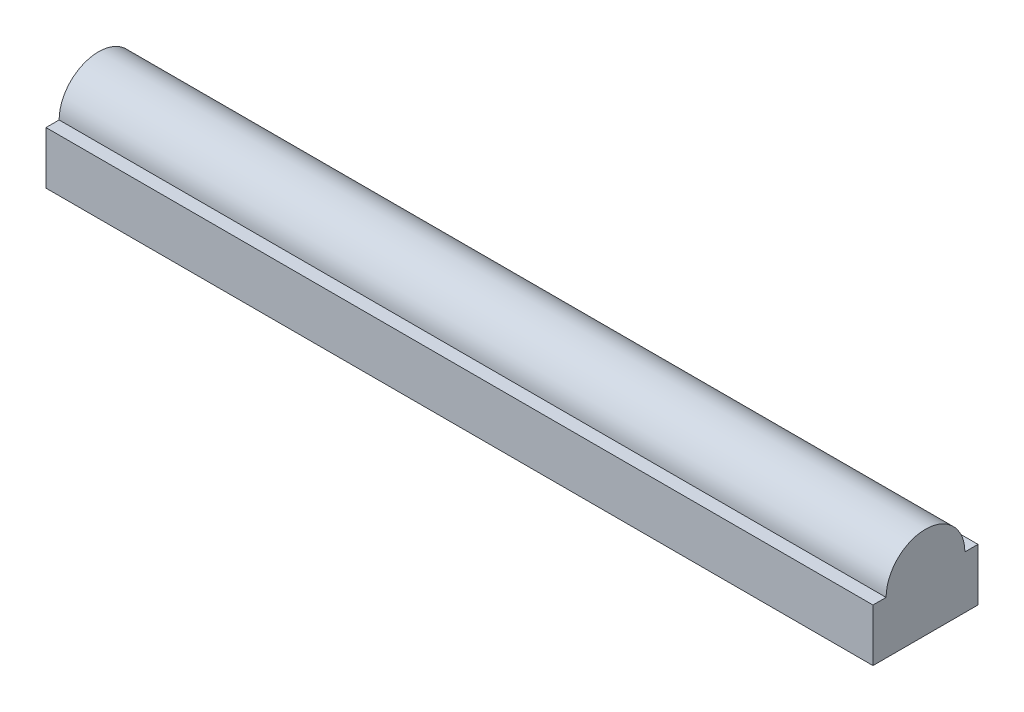
ISO-10303-21;
HEADER;
FILE_DESCRIPTION(('STEP AP214'),'2;1');
FILE_NAME('part.step','',(''),(''),'','','');
FILE_SCHEMA(('AUTOMOTIVE_DESIGN { 1 0 10303 214 1 1 1 1 }'));
ENDSEC;
DATA;
#1=APPLICATION_CONTEXT('core data for automotive mechanical design processes');
#2=APPLICATION_PROTOCOL_DEFINITION('international standard','automotive_design',2000,#1);
#3=PRODUCT_CONTEXT('',#1,'mechanical');
#4=PRODUCT('Part','Part','',(#3));
#5=PRODUCT_RELATED_PRODUCT_CATEGORY('part','',(#4));
#6=PRODUCT_DEFINITION_FORMATION('','',#4);
#7=PRODUCT_DEFINITION_CONTEXT('part definition',#1,'design');
#8=PRODUCT_DEFINITION('design','',#6,#7);
#9=PRODUCT_DEFINITION_SHAPE('','',#8);
#10=(LENGTH_UNIT() NAMED_UNIT(*) SI_UNIT(.MILLI.,.METRE.));
#11=(NAMED_UNIT(*) PLANE_ANGLE_UNIT() SI_UNIT($,.RADIAN.));
#12=(NAMED_UNIT(*) SI_UNIT($,.STERADIAN.) SOLID_ANGLE_UNIT());
#13=UNCERTAINTY_MEASURE_WITH_UNIT(LENGTH_MEASURE(1.E-05),#10,'distance_accuracy_value','');
#14=(GEOMETRIC_REPRESENTATION_CONTEXT(3) GLOBAL_UNCERTAINTY_ASSIGNED_CONTEXT((#13)) GLOBAL_UNIT_ASSIGNED_CONTEXT((#10,
#11,#12)) REPRESENTATION_CONTEXT('',''));
#15=CARTESIAN_POINT('',(0.,0.,0.));
#16=DIRECTION('',(0.,0.,1.));
#17=DIRECTION('',(1.,0.,0.));
#18=AXIS2_PLACEMENT_3D('',#15,#16,#17);
#19=CARTESIAN_POINT('',(400.,25.4,0.));
#20=DIRECTION('',(0.,0.,-1.));
#21=DIRECTION('',(-1.,0.,0.));
#22=AXIS2_PLACEMENT_3D('',#19,#20,#21);
#23=PLANE('',#22);
#24=DIRECTION('',(0.,-1.,0.));
#25=VECTOR('',#24,1.);
#26=CARTESIAN_POINT('',(0.,25.4,0.));
#27=LINE('',#26,#25);
#28=CARTESIAN_POINT('',(0.,25.4,0.));
#29=VERTEX_POINT('',#28);
#30=CARTESIAN_POINT('',(0.,0.,0.));
#31=VERTEX_POINT('',#30);
#32=EDGE_CURVE('E117',#29,#31,#27,.T.);
#33=ORIENTED_EDGE('',*,*,#32,.T.);
#34=DIRECTION('',(-1.,0.,0.));
#35=VECTOR('',#34,1.);
#36=CARTESIAN_POINT('',(400.,0.,0.));
#37=LINE('',#36,#35);
#38=CARTESIAN_POINT('',(400.,0.,0.));
#39=VERTEX_POINT('',#38);
#40=EDGE_CURVE('E11',#39,#31,#37,.T.);
#41=ORIENTED_EDGE('',*,*,#40,.F.);
#42=DIRECTION('',(0.,-1.,0.));
#43=VECTOR('',#42,1.);
#44=CARTESIAN_POINT('',(400.,25.4,0.));
#45=LINE('',#44,#43);
#46=CARTESIAN_POINT('',(400.,25.4,0.));
#47=VERTEX_POINT('',#46);
#48=EDGE_CURVE('E127',#47,#39,#45,.T.);
#49=ORIENTED_EDGE('',*,*,#48,.F.);
#50=DIRECTION('',(-1.,0.,0.));
#51=VECTOR('',#50,1.);
#52=CARTESIAN_POINT('',(400.,25.4,0.));
#53=LINE('',#52,#51);
#54=EDGE_CURVE('E113',#47,#29,#53,.T.);
#55=ORIENTED_EDGE('',*,*,#54,.T.);
#56=EDGE_LOOP('',(#33,#41,#49,#55));
#57=FACE_BOUND('',#56,.T.);
#58=ADVANCED_FACE('F33',(#57),#23,.F.);
#59=CARTESIAN_POINT('',(400.,0.,0.));
#60=DIRECTION('',(0.,1.,0.));
#61=DIRECTION('',(0.,0.,1.));
#62=AXIS2_PLACEMENT_3D('',#59,#60,#61);
#63=PLANE('',#62);
#64=DIRECTION('',(0.,0.,-1.));
#65=VECTOR('',#64,1.);
#66=CARTESIAN_POINT('',(0.,0.,0.));
#67=LINE('',#66,#65);
#68=CARTESIAN_POINT('',(0.,0.,-50.8));
#69=VERTEX_POINT('',#68);
#70=EDGE_CURVE('E120',#31,#69,#67,.T.);
#71=ORIENTED_EDGE('',*,*,#70,.T.);
#72=DIRECTION('',(-1.,0.,0.));
#73=VECTOR('',#72,1.);
#74=CARTESIAN_POINT('',(400.,0.,-50.8));
#75=LINE('',#74,#73);
#76=CARTESIAN_POINT('',(400.,0.,-50.8));
#77=VERTEX_POINT('',#76);
#78=EDGE_CURVE('E41',#77,#69,#75,.T.);
#79=ORIENTED_EDGE('',*,*,#78,.F.);
#80=DIRECTION('',(0.,0.,-1.));
#81=VECTOR('',#80,1.);
#82=CARTESIAN_POINT('',(400.,0.,0.));
#83=LINE('',#82,#81);
#84=EDGE_CURVE('E86',#39,#77,#83,.T.);
#85=ORIENTED_EDGE('',*,*,#84,.F.);
#86=ORIENTED_EDGE('',*,*,#40,.T.);
#87=EDGE_LOOP('',(#71,#79,#85,#86));
#88=FACE_BOUND('',#87,.T.);
#89=ADVANCED_FACE('F151',(#88),#63,.F.);
#90=CARTESIAN_POINT('',(400.,0.,-50.8));
#91=DIRECTION('',(0.,0.,1.));
#92=DIRECTION('',(1.,0.,0.));
#93=AXIS2_PLACEMENT_3D('',#90,#91,#92);
#94=PLANE('',#93);
#95=DIRECTION('',(0.,1.,0.));
#96=VECTOR('',#95,1.);
#97=CARTESIAN_POINT('',(0.,0.,-50.8));
#98=LINE('',#97,#96);
#99=CARTESIAN_POINT('',(0.,25.4,-50.8));
#100=VERTEX_POINT('',#99);
#101=EDGE_CURVE('E122',#69,#100,#98,.T.);
#102=ORIENTED_EDGE('',*,*,#101,.T.);
#103=DIRECTION('',(-1.,0.,0.));
#104=VECTOR('',#103,1.);
#105=CARTESIAN_POINT('',(400.,25.4,-50.8));
#106=LINE('',#105,#104);
#107=CARTESIAN_POINT('',(400.,25.4,-50.8));
#108=VERTEX_POINT('',#107);
#109=EDGE_CURVE('E108',#108,#100,#106,.T.);
#110=ORIENTED_EDGE('',*,*,#109,.F.);
#111=DIRECTION('',(0.,1.,0.));
#112=VECTOR('',#111,1.);
#113=CARTESIAN_POINT('',(400.,0.,-50.8));
#114=LINE('',#113,#112);
#115=EDGE_CURVE('E99',#77,#108,#114,.T.);
#116=ORIENTED_EDGE('',*,*,#115,.F.);
#117=ORIENTED_EDGE('',*,*,#78,.T.);
#118=EDGE_LOOP('',(#102,#110,#116,#117));
#119=FACE_BOUND('',#118,.T.);
#120=ADVANCED_FACE('F133',(#119),#94,.F.);
#121=CARTESIAN_POINT('',(400.,25.4,-50.8));
#122=DIRECTION('',(0.,-1.,0.));
#123=DIRECTION('',(0.,0.,-1.));
#124=AXIS2_PLACEMENT_3D('',#121,#122,#123);
#125=PLANE('',#124);
#126=DIRECTION('',(0.,0.,1.));
#127=VECTOR('',#126,1.);
#128=CARTESIAN_POINT('',(0.,25.4,-50.8));
#129=LINE('',#128,#127);
#130=CARTESIAN_POINT('',(0.,25.4,-44.45));
#131=VERTEX_POINT('',#130);
#132=EDGE_CURVE('E107',#100,#131,#129,.T.);
#133=ORIENTED_EDGE('',*,*,#132,.T.);
#134=DIRECTION('',(-1.,0.,0.));
#135=VECTOR('',#134,1.);
#136=CARTESIAN_POINT('',(400.,25.4,-44.45));
#137=LINE('',#136,#135);
#138=CARTESIAN_POINT('',(400.,25.4,-44.45));
#139=VERTEX_POINT('',#138);
#140=EDGE_CURVE('E104',#139,#131,#137,.T.);
#141=ORIENTED_EDGE('',*,*,#140,.F.);
#142=DIRECTION('',(0.,0.,1.));
#143=VECTOR('',#142,1.);
#144=CARTESIAN_POINT('',(400.,25.4,-50.8));
#145=LINE('',#144,#143);
#146=EDGE_CURVE('E93',#108,#139,#145,.T.);
#147=ORIENTED_EDGE('',*,*,#146,.F.);
#148=ORIENTED_EDGE('',*,*,#109,.T.);
#149=EDGE_LOOP('',(#133,#141,#147,#148));
#150=FACE_BOUND('',#149,.T.);
#151=ADVANCED_FACE('F105',(#150),#125,.F.);
#152=CARTESIAN_POINT('',(400.,25.4,-25.4));
#153=DIRECTION('',(-1.,0.,0.));
#154=DIRECTION('',(0.,0.,1.));
#155=AXIS2_PLACEMENT_3D('',#152,#153,#154);
#156=CYLINDRICAL_SURFACE('',#155,19.05);
#157=CARTESIAN_POINT('',(0.,25.4,-25.4));
#158=DIRECTION('',(1.,0.,0.));
#159=DIRECTION('',(0.,0.,-1.));
#160=AXIS2_PLACEMENT_3D('',#157,#158,#159);
#161=CIRCLE('',#160,19.05);
#162=CARTESIAN_POINT('',(0.,25.4,-6.34999999999999));
#163=VERTEX_POINT('',#162);
#164=EDGE_CURVE('E72',#131,#163,#161,.T.);
#165=ORIENTED_EDGE('',*,*,#164,.T.);
#166=DIRECTION('',(-1.,0.,0.));
#167=VECTOR('',#166,1.);
#168=CARTESIAN_POINT('',(400.,25.4,-6.34999999999999));
#169=LINE('',#168,#167);
#170=CARTESIAN_POINT('',(400.,25.4,-6.34999999999999));
#171=VERTEX_POINT('',#170);
#172=EDGE_CURVE('E109',#171,#163,#169,.T.);
#173=ORIENTED_EDGE('',*,*,#172,.F.);
#174=CARTESIAN_POINT('',(400.,25.4,-25.4));
#175=DIRECTION('',(1.,0.,0.));
#176=DIRECTION('',(0.,0.,-1.));
#177=AXIS2_PLACEMENT_3D('',#174,#175,#176);
#178=CIRCLE('',#177,19.05);
#179=EDGE_CURVE('E97',#139,#171,#178,.T.);
#180=ORIENTED_EDGE('',*,*,#179,.F.);
#181=ORIENTED_EDGE('',*,*,#140,.T.);
#182=EDGE_LOOP('',(#165,#173,#180,#181));
#183=FACE_BOUND('',#182,.T.);
#184=ADVANCED_FACE('F111',(#183),#156,.T.);
#185=CARTESIAN_POINT('',(400.,25.4,-6.34999999999999));
#186=DIRECTION('',(0.,-1.,0.));
#187=DIRECTION('',(0.,0.,-1.));
#188=AXIS2_PLACEMENT_3D('',#185,#186,#187);
#189=PLANE('',#188);
#190=DIRECTION('',(0.,0.,1.));
#191=VECTOR('',#190,1.);
#192=CARTESIAN_POINT('',(0.,25.4,-6.34999999999999));
#193=LINE('',#192,#191);
#194=EDGE_CURVE('E78',#163,#29,#193,.T.);
#195=ORIENTED_EDGE('',*,*,#194,.T.);
#196=ORIENTED_EDGE('',*,*,#54,.F.);
#197=DIRECTION('',(0.,0.,1.));
#198=VECTOR('',#197,1.);
#199=CARTESIAN_POINT('',(400.,25.4,-6.34999999999999));
#200=LINE('',#199,#198);
#201=EDGE_CURVE('E49',#171,#47,#200,.T.);
#202=ORIENTED_EDGE('',*,*,#201,.F.);
#203=ORIENTED_EDGE('',*,*,#172,.T.);
#204=EDGE_LOOP('',(#195,#196,#202,#203));
#205=FACE_BOUND('',#204,.T.);
#206=ADVANCED_FACE('F140',(#205),#189,.F.);
#207=CARTESIAN_POINT('',(400.,25.4,-25.4));
#208=DIRECTION('',(1.,0.,0.));
#209=DIRECTION('',(0.,0.,-1.));
#210=AXIS2_PLACEMENT_3D('',#207,#208,#209);
#211=PLANE('',#210);
#212=ORIENTED_EDGE('',*,*,#48,.T.);
#213=ORIENTED_EDGE('',*,*,#84,.T.);
#214=ORIENTED_EDGE('',*,*,#115,.T.);
#215=ORIENTED_EDGE('',*,*,#146,.T.);
#216=ORIENTED_EDGE('',*,*,#179,.T.);
#217=ORIENTED_EDGE('',*,*,#201,.T.);
#218=EDGE_LOOP('',(#212,#213,#214,#215,#216,#217));
#219=FACE_BOUND('',#218,.T.);
#220=ADVANCED_FACE('F95',(#219),#211,.T.);
#221=CARTESIAN_POINT('',(0.,25.4,-25.4));
#222=DIRECTION('',(1.,0.,0.));
#223=DIRECTION('',(0.,0.,-1.));
#224=AXIS2_PLACEMENT_3D('',#221,#222,#223);
#225=PLANE('',#224);
#226=ORIENTED_EDGE('',*,*,#32,.F.);
#227=ORIENTED_EDGE('',*,*,#194,.F.);
#228=ORIENTED_EDGE('',*,*,#164,.F.);
#229=ORIENTED_EDGE('',*,*,#132,.F.);
#230=ORIENTED_EDGE('',*,*,#101,.F.);
#231=ORIENTED_EDGE('',*,*,#70,.F.);
#232=EDGE_LOOP('',(#226,#227,#228,#229,#230,#231));
#233=FACE_BOUND('',#232,.T.);
#234=ADVANCED_FACE('F136',(#233),#225,.F.);
#235=CLOSED_SHELL('',(#58,#89,#120,#151,#184,#206,#220,#234));
#236=MANIFOLD_SOLID_BREP('B2',#235);
#237=ADVANCED_BREP_SHAPE_REPRESENTATION('',(#18,#236),#14);
#238=SHAPE_DEFINITION_REPRESENTATION(#9,#237);
ENDSEC;
END-ISO-10303-21;
